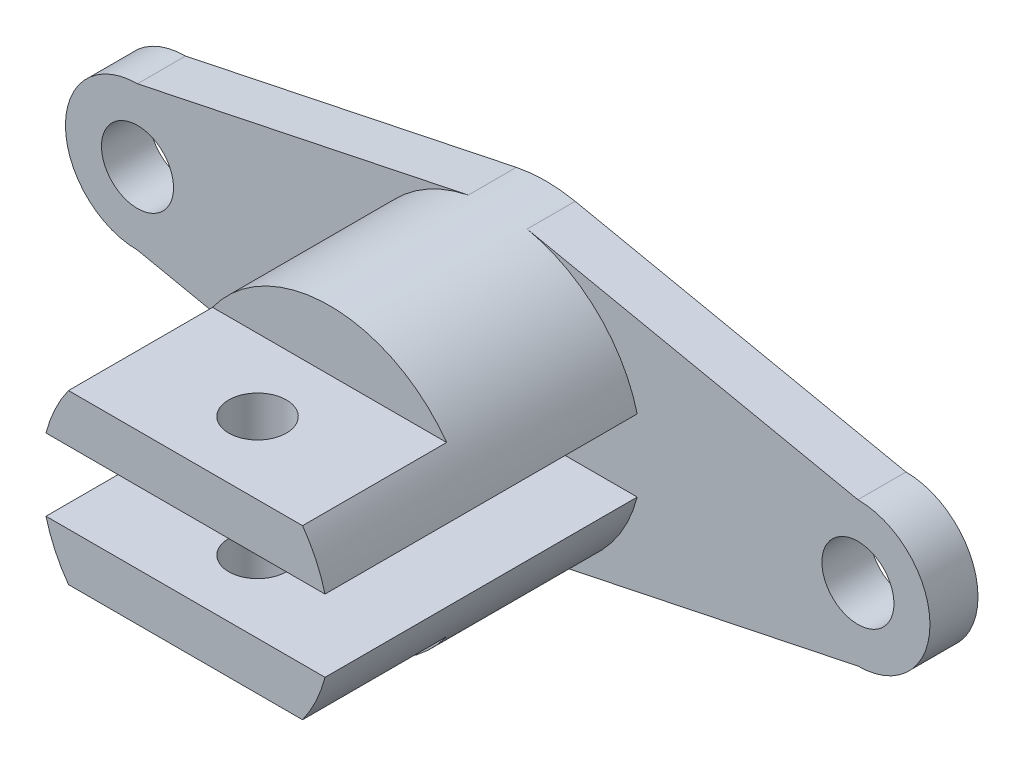
ISO-10303-21;
HEADER;
FILE_DESCRIPTION(('STEP AP214'),'2;1');
FILE_NAME('part.step','',(''),(''),'','','');
FILE_SCHEMA(('AUTOMOTIVE_DESIGN { 1 0 10303 214 1 1 1 1 }'));
ENDSEC;
DATA;
#1=APPLICATION_CONTEXT('core data for automotive mechanical design processes');
#2=APPLICATION_PROTOCOL_DEFINITION('international standard','automotive_design',2000,#1);
#3=PRODUCT_CONTEXT('',#1,'mechanical');
#4=PRODUCT('Part','Part','',(#3));
#5=PRODUCT_RELATED_PRODUCT_CATEGORY('part','',(#4));
#6=PRODUCT_DEFINITION_FORMATION('','',#4);
#7=PRODUCT_DEFINITION_CONTEXT('part definition',#1,'design');
#8=PRODUCT_DEFINITION('design','',#6,#7);
#9=PRODUCT_DEFINITION_SHAPE('','',#8);
#10=(LENGTH_UNIT() NAMED_UNIT(*) SI_UNIT(.MILLI.,.METRE.));
#11=(NAMED_UNIT(*) PLANE_ANGLE_UNIT() SI_UNIT($,.RADIAN.));
#12=(NAMED_UNIT(*) SI_UNIT($,.STERADIAN.) SOLID_ANGLE_UNIT());
#13=UNCERTAINTY_MEASURE_WITH_UNIT(LENGTH_MEASURE(1.E-05),#10,'distance_accuracy_value','');
#14=(GEOMETRIC_REPRESENTATION_CONTEXT(3) GLOBAL_UNCERTAINTY_ASSIGNED_CONTEXT((#13)) GLOBAL_UNIT_ASSIGNED_CONTEXT((#10,
#11,#12)) REPRESENTATION_CONTEXT('',''));
#15=CARTESIAN_POINT('',(0.,0.,0.));
#16=DIRECTION('',(0.,0.,1.));
#17=DIRECTION('',(1.,0.,0.));
#18=AXIS2_PLACEMENT_3D('',#15,#16,#17);
#19=CARTESIAN_POINT('',(0.,0.,10.));
#20=DIRECTION('',(0.,0.,-1.));
#21=DIRECTION('',(-1.,0.,0.));
#22=AXIS2_PLACEMENT_3D('',#19,#20,#21);
#23=CYLINDRICAL_SURFACE('',#22,30.);
#24=CARTESIAN_POINT('',(0.,0.,75.));
#25=DIRECTION('',(0.,0.,1.));
#26=DIRECTION('',(1.,0.,0.));
#27=AXIS2_PLACEMENT_3D('',#24,#25,#26);
#28=CIRCLE('',#27,30.);
#29=CARTESIAN_POINT('',(-24.3669858620224,17.5,75.));
#30=VERTEX_POINT('',#29);
#31=CARTESIAN_POINT('',(-29.0473750965556,7.5,75.));
#32=VERTEX_POINT('',#31);
#33=EDGE_CURVE('E203',#30,#32,#28,.T.);
#34=ORIENTED_EDGE('',*,*,#33,.F.);
#35=DIRECTION('',(0.,0.,1.));
#36=VECTOR('',#35,1.);
#37=CARTESIAN_POINT('',(-24.3669858620224,17.5,45.));
#38=LINE('',#37,#36);
#39=CARTESIAN_POINT('',(-24.3669858620224,17.5,45.));
#40=VERTEX_POINT('',#39);
#41=EDGE_CURVE('E58',#40,#30,#38,.T.);
#42=ORIENTED_EDGE('',*,*,#41,.F.);
#43=CARTESIAN_POINT('',(0.,0.,45.));
#44=DIRECTION('',(0.,0.,1.));
#45=DIRECTION('',(1.,0.,0.));
#46=AXIS2_PLACEMENT_3D('',#43,#44,#45);
#47=CIRCLE('',#46,30.);
#48=CARTESIAN_POINT('',(24.3669858620224,17.5,45.));
#49=VERTEX_POINT('',#48);
#50=EDGE_CURVE('E169',#49,#40,#47,.T.);
#51=ORIENTED_EDGE('',*,*,#50,.F.);
#52=DIRECTION('',(0.,0.,1.));
#53=VECTOR('',#52,1.);
#54=CARTESIAN_POINT('',(24.3669858620224,17.5,45.));
#55=LINE('',#54,#53);
#56=CARTESIAN_POINT('',(24.3669858620224,17.5,75.));
#57=VERTEX_POINT('',#56);
#58=EDGE_CURVE('E175',#49,#57,#55,.T.);
#59=ORIENTED_EDGE('',*,*,#58,.T.);
#60=CARTESIAN_POINT('',(29.0473750965556,7.5,75.));
#61=VERTEX_POINT('',#60);
#62=EDGE_CURVE('E200',#61,#57,#28,.T.);
#63=ORIENTED_EDGE('',*,*,#62,.F.);
#64=DIRECTION('',(0.,0.,1.));
#65=VECTOR('',#64,1.);
#66=CARTESIAN_POINT('',(29.0473750965556,7.5,9.99999999999999));
#67=LINE('',#66,#65);
#68=CARTESIAN_POINT('',(29.0473750965556,7.5,9.99999999999999));
#69=VERTEX_POINT('',#68);
#70=EDGE_CURVE('E195',#69,#61,#67,.T.);
#71=ORIENTED_EDGE('',*,*,#70,.F.);
#72=CARTESIAN_POINT('',(0.,0.,10.));
#73=DIRECTION('',(0.,0.,1.));
#74=DIRECTION('',(1.,0.,0.));
#75=AXIS2_PLACEMENT_3D('',#72,#73,#74);
#76=CIRCLE('',#75,30.);
#77=CARTESIAN_POINT('',(6.12644335404989,29.3677832297506,10.));
#78=VERTEX_POINT('',#77);
#79=EDGE_CURVE('E271',#69,#78,#76,.T.);
#80=ORIENTED_EDGE('',*,*,#79,.T.);
#81=DIRECTION('',(0.,0.,-1.));
#82=VECTOR('',#81,1.);
#83=CARTESIAN_POINT('',(6.12644335404989,29.3677832297506,10.));
#84=LINE('',#83,#82);
#85=CARTESIAN_POINT('',(6.12644335404989,29.3677832297506,0.));
#86=VERTEX_POINT('',#85);
#87=EDGE_CURVE('E267',#78,#86,#84,.T.);
#88=ORIENTED_EDGE('',*,*,#87,.T.);
#89=CARTESIAN_POINT('',(0.,0.,0.));
#90=DIRECTION('',(0.,0.,1.));
#91=DIRECTION('',(1.,0.,0.));
#92=AXIS2_PLACEMENT_3D('',#89,#90,#91);
#93=CIRCLE('',#92,30.);
#94=CARTESIAN_POINT('',(-6.12644335404989,29.3677832297506,0.));
#95=VERTEX_POINT('',#94);
#96=EDGE_CURVE('E239',#86,#95,#93,.T.);
#97=ORIENTED_EDGE('',*,*,#96,.T.);
#98=DIRECTION('',(0.,0.,-1.));
#99=VECTOR('',#98,1.);
#100=CARTESIAN_POINT('',(-6.12644335404989,29.3677832297506,10.));
#101=LINE('',#100,#99);
#102=CARTESIAN_POINT('',(-6.12644335404989,29.3677832297506,10.));
#103=VERTEX_POINT('',#102);
#104=EDGE_CURVE('E264',#103,#95,#101,.T.);
#105=ORIENTED_EDGE('',*,*,#104,.F.);
#106=CARTESIAN_POINT('',(-29.0473750965556,7.5,9.99999999999999));
#107=VERTEX_POINT('',#106);
#108=EDGE_CURVE('E11',#103,#107,#76,.T.);
#109=ORIENTED_EDGE('',*,*,#108,.T.);
#110=DIRECTION('',(0.,0.,1.));
#111=VECTOR('',#110,1.);
#112=CARTESIAN_POINT('',(-29.0473750965556,7.5,9.99999999999999));
#113=LINE('',#112,#111);
#114=EDGE_CURVE('E192',#107,#32,#113,.T.);
#115=ORIENTED_EDGE('',*,*,#114,.T.);
#116=EDGE_LOOP('',(#34,#42,#51,#59,#63,#71,#80,#88,#97,#105,#109,#115));
#117=FACE_BOUND('',#116,.T.);
#118=ADVANCED_FACE('F32',(#117),#23,.T.);
#119=CARTESIAN_POINT('',(0.,0.,75.));
#120=DIRECTION('',(0.,0.,1.));
#121=DIRECTION('',(1.,0.,0.));
#122=AXIS2_PLACEMENT_3D('',#119,#120,#121);
#123=PLANE('',#122);
#124=DIRECTION('',(1.,0.,0.));
#125=VECTOR('',#124,1.);
#126=CARTESIAN_POINT('',(-24.3669858620224,17.5,75.));
#127=LINE('',#126,#125);
#128=EDGE_CURVE('E165',#30,#57,#127,.T.);
#129=ORIENTED_EDGE('',*,*,#128,.F.);
#130=ORIENTED_EDGE('',*,*,#33,.T.);
#131=DIRECTION('',(-1.,0.,0.));
#132=VECTOR('',#131,1.);
#133=CARTESIAN_POINT('',(-29.0473750965556,7.5,75.));
#134=LINE('',#133,#132);
#135=EDGE_CURVE('E184',#61,#32,#134,.T.);
#136=ORIENTED_EDGE('',*,*,#135,.F.);
#137=ORIENTED_EDGE('',*,*,#62,.T.);
#138=EDGE_LOOP('',(#129,#130,#136,#137));
#139=FACE_BOUND('',#138,.T.);
#140=ADVANCED_FACE('F315',(#139),#123,.T.);
#141=CARTESIAN_POINT('',(75.,0.,10.));
#142=DIRECTION('',(0.,0.,1.));
#143=DIRECTION('',(1.,0.,0.));
#144=AXIS2_PLACEMENT_3D('',#141,#142,#143);
#145=PLANE('',#144);
#146=CARTESIAN_POINT('',(6.12644335404988,-29.3677832297506,10.));
#147=VERTEX_POINT('',#146);
#148=CARTESIAN_POINT('',(29.0473750965556,-7.50000000000001,9.99999999999999));
#149=VERTEX_POINT('',#148);
#150=EDGE_CURVE('E43',#147,#149,#76,.T.);
#151=ORIENTED_EDGE('',*,*,#150,.F.);
#152=DIRECTION('',(0.978926107658352,0.20421477846833,0.));
#153=VECTOR('',#152,1.);
#154=CARTESIAN_POINT('',(75.,-15.,10.));
#155=LINE('',#154,#153);
#156=CARTESIAN_POINT('',(75.,-15.,10.));
#157=VERTEX_POINT('',#156);
#158=EDGE_CURVE('E232',#147,#157,#155,.T.);
#159=ORIENTED_EDGE('',*,*,#158,.T.);
#160=CARTESIAN_POINT('',(75.,0.,10.));
#161=DIRECTION('',(0.,0.,1.));
#162=DIRECTION('',(1.,0.,0.));
#163=AXIS2_PLACEMENT_3D('',#160,#161,#162);
#164=CIRCLE('',#163,15.);
#165=CARTESIAN_POINT('',(75.,15.,10.));
#166=VERTEX_POINT('',#165);
#167=EDGE_CURVE('E218',#157,#166,#164,.T.);
#168=ORIENTED_EDGE('',*,*,#167,.T.);
#169=DIRECTION('',(-0.978926107658352,0.20421477846833,0.));
#170=VECTOR('',#169,1.);
#171=CARTESIAN_POINT('',(75.,15.,10.));
#172=LINE('',#171,#170);
#173=EDGE_CURVE('E221',#166,#78,#172,.T.);
#174=ORIENTED_EDGE('',*,*,#173,.T.);
#175=ORIENTED_EDGE('',*,*,#79,.F.);
#176=DIRECTION('',(-1.,0.,0.));
#177=VECTOR('',#176,1.);
#178=CARTESIAN_POINT('',(-29.0473750965556,7.5,9.99999999999999));
#179=LINE('',#178,#177);
#180=EDGE_CURVE('E183',#69,#107,#179,.T.);
#181=ORIENTED_EDGE('',*,*,#180,.T.);
#182=ORIENTED_EDGE('',*,*,#108,.F.);
#183=DIRECTION('',(-0.978926107658352,-0.20421477846833,0.));
#184=VECTOR('',#183,1.);
#185=CARTESIAN_POINT('',(-75.,15.,10.));
#186=LINE('',#185,#184);
#187=CARTESIAN_POINT('',(-75.,15.,10.));
#188=VERTEX_POINT('',#187);
#189=EDGE_CURVE('E225',#103,#188,#186,.T.);
#190=ORIENTED_EDGE('',*,*,#189,.T.);
#191=CARTESIAN_POINT('',(-75.,0.,10.));
#192=DIRECTION('',(0.,0.,1.));
#193=DIRECTION('',(1.,0.,0.));
#194=AXIS2_PLACEMENT_3D('',#191,#192,#193);
#195=CIRCLE('',#194,15.);
#196=CARTESIAN_POINT('',(-75.,-15.,10.));
#197=VERTEX_POINT('',#196);
#198=EDGE_CURVE('E227',#188,#197,#195,.T.);
#199=ORIENTED_EDGE('',*,*,#198,.T.);
#200=DIRECTION('',(0.978926107658352,-0.204214778468329,0.));
#201=VECTOR('',#200,1.);
#202=CARTESIAN_POINT('',(-75.,-15.,10.));
#203=LINE('',#202,#201);
#204=CARTESIAN_POINT('',(-6.12644335404989,-29.3677832297505,10.));
#205=VERTEX_POINT('',#204);
#206=EDGE_CURVE('E229',#197,#205,#203,.T.);
#207=ORIENTED_EDGE('',*,*,#206,.T.);
#208=CARTESIAN_POINT('',(-29.0473750965556,-7.5,9.99999999999999));
#209=VERTEX_POINT('',#208);
#210=EDGE_CURVE('E41',#209,#205,#76,.T.);
#211=ORIENTED_EDGE('',*,*,#210,.F.);
#212=DIRECTION('',(1.,0.,0.));
#213=VECTOR('',#212,1.);
#214=CARTESIAN_POINT('',(-29.0473750965556,-7.5,9.99999999999999));
#215=LINE('',#214,#213);
#216=EDGE_CURVE('E180',#209,#149,#215,.T.);
#217=ORIENTED_EDGE('',*,*,#216,.T.);
#218=EDGE_LOOP('',(#151,#159,#168,#174,#175,#181,#182,#190,#199,#207,#211,#217));
#219=FACE_BOUND('',#218,.T.);
#220=CARTESIAN_POINT('',(75.,0.,10.));
#221=DIRECTION('',(0.,0.,1.));
#222=DIRECTION('',(1.,0.,0.));
#223=AXIS2_PLACEMENT_3D('',#220,#221,#222);
#224=CIRCLE('',#223,7.50000000000001);
#225=CARTESIAN_POINT('',(82.5,0.,10.));
#226=VERTEX_POINT('',#225);
#227=EDGE_CURVE('E212',#226,#226,#224,.T.);
#228=ORIENTED_EDGE('',*,*,#227,.F.);
#229=EDGE_LOOP('',(#228));
#230=FACE_BOUND('',#229,.T.);
#231=CARTESIAN_POINT('',(-75.,0.,10.));
#232=DIRECTION('',(0.,0.,1.));
#233=DIRECTION('',(1.,0.,0.));
#234=AXIS2_PLACEMENT_3D('',#231,#232,#233);
#235=CIRCLE('',#234,7.5);
#236=CARTESIAN_POINT('',(-67.5,0.,10.));
#237=VERTEX_POINT('',#236);
#238=EDGE_CURVE('E206',#237,#237,#235,.T.);
#239=ORIENTED_EDGE('',*,*,#238,.F.);
#240=EDGE_LOOP('',(#239));
#241=FACE_BOUND('',#240,.T.);
#242=ADVANCED_FACE('F286',(#219,#230,#241),#145,.T.);
#243=CARTESIAN_POINT('',(75.,0.,0.));
#244=DIRECTION('',(0.,0.,1.));
#245=DIRECTION('',(1.,0.,0.));
#246=AXIS2_PLACEMENT_3D('',#243,#244,#245);
#247=PLANE('',#246);
#248=CARTESIAN_POINT('',(75.,0.,0.));
#249=DIRECTION('',(0.,0.,1.));
#250=DIRECTION('',(1.,0.,0.));
#251=AXIS2_PLACEMENT_3D('',#248,#249,#250);
#252=CIRCLE('',#251,15.);
#253=CARTESIAN_POINT('',(75.,-15.,0.));
#254=VERTEX_POINT('',#253);
#255=CARTESIAN_POINT('',(75.,15.,0.));
#256=VERTEX_POINT('',#255);
#257=EDGE_CURVE('E215',#254,#256,#252,.T.);
#258=ORIENTED_EDGE('',*,*,#257,.F.);
#259=DIRECTION('',(0.978926107658352,0.20421477846833,0.));
#260=VECTOR('',#259,1.);
#261=CARTESIAN_POINT('',(75.,-15.,0.));
#262=LINE('',#261,#260);
#263=CARTESIAN_POINT('',(6.12644335404988,-29.3677832297506,0.));
#264=VERTEX_POINT('',#263);
#265=EDGE_CURVE('E222',#264,#254,#262,.T.);
#266=ORIENTED_EDGE('',*,*,#265,.F.);
#267=CARTESIAN_POINT('',(0.,0.,0.));
#268=DIRECTION('',(0.,0.,1.));
#269=DIRECTION('',(1.,0.,0.));
#270=AXIS2_PLACEMENT_3D('',#267,#268,#269);
#271=CIRCLE('',#270,30.);
#272=CARTESIAN_POINT('',(-6.12644335404989,-29.3677832297505,0.));
#273=VERTEX_POINT('',#272);
#274=EDGE_CURVE('E247',#273,#264,#271,.T.);
#275=ORIENTED_EDGE('',*,*,#274,.F.);
#276=DIRECTION('',(0.978926107658352,-0.204214778468329,0.));
#277=VECTOR('',#276,1.);
#278=CARTESIAN_POINT('',(-75.,-15.,0.));
#279=LINE('',#278,#277);
#280=CARTESIAN_POINT('',(-75.,-15.,0.));
#281=VERTEX_POINT('',#280);
#282=EDGE_CURVE('E245',#281,#273,#279,.T.);
#283=ORIENTED_EDGE('',*,*,#282,.F.);
#284=CARTESIAN_POINT('',(-75.,0.,0.));
#285=DIRECTION('',(0.,0.,1.));
#286=DIRECTION('',(1.,0.,0.));
#287=AXIS2_PLACEMENT_3D('',#284,#285,#286);
#288=CIRCLE('',#287,15.);
#289=CARTESIAN_POINT('',(-75.,15.,0.));
#290=VERTEX_POINT('',#289);
#291=EDGE_CURVE('E243',#290,#281,#288,.T.);
#292=ORIENTED_EDGE('',*,*,#291,.F.);
#293=DIRECTION('',(-0.978926107658352,-0.20421477846833,0.));
#294=VECTOR('',#293,1.);
#295=CARTESIAN_POINT('',(-75.,15.,0.));
#296=LINE('',#295,#294);
#297=EDGE_CURVE('E241',#95,#290,#296,.T.);
#298=ORIENTED_EDGE('',*,*,#297,.F.);
#299=ORIENTED_EDGE('',*,*,#96,.F.);
#300=DIRECTION('',(-0.978926107658352,0.20421477846833,0.));
#301=VECTOR('',#300,1.);
#302=CARTESIAN_POINT('',(75.,15.,0.));
#303=LINE('',#302,#301);
#304=EDGE_CURVE('E237',#256,#86,#303,.T.);
#305=ORIENTED_EDGE('',*,*,#304,.F.);
#306=EDGE_LOOP('',(#258,#266,#275,#283,#292,#298,#299,#305));
#307=FACE_BOUND('',#306,.T.);
#308=CARTESIAN_POINT('',(75.,0.,0.));
#309=DIRECTION('',(0.,0.,1.));
#310=DIRECTION('',(1.,0.,0.));
#311=AXIS2_PLACEMENT_3D('',#308,#309,#310);
#312=CIRCLE('',#311,7.50000000000001);
#313=CARTESIAN_POINT('',(82.5,0.,0.));
#314=VERTEX_POINT('',#313);
#315=EDGE_CURVE('E209',#314,#314,#312,.T.);
#316=ORIENTED_EDGE('',*,*,#315,.T.);
#317=EDGE_LOOP('',(#316));
#318=FACE_BOUND('',#317,.T.);
#319=CARTESIAN_POINT('',(-75.,0.,0.));
#320=DIRECTION('',(0.,0.,1.));
#321=DIRECTION('',(1.,0.,0.));
#322=AXIS2_PLACEMENT_3D('',#319,#320,#321);
#323=CIRCLE('',#322,7.5);
#324=CARTESIAN_POINT('',(-67.5,0.,0.));
#325=VERTEX_POINT('',#324);
#326=EDGE_CURVE('E202',#325,#325,#323,.T.);
#327=ORIENTED_EDGE('',*,*,#326,.T.);
#328=EDGE_LOOP('',(#327));
#329=FACE_BOUND('',#328,.T.);
#330=ADVANCED_FACE('F296',(#307,#318,#329),#247,.F.);
#331=CARTESIAN_POINT('',(75.,0.,10.));
#332=DIRECTION('',(0.,0.,-1.));
#333=DIRECTION('',(-1.,0.,0.));
#334=AXIS2_PLACEMENT_3D('',#331,#332,#333);
#335=CYLINDRICAL_SURFACE('',#334,15.);
#336=ORIENTED_EDGE('',*,*,#257,.T.);
#337=DIRECTION('',(0.,0.,-1.));
#338=VECTOR('',#337,1.);
#339=CARTESIAN_POINT('',(75.,15.,10.));
#340=LINE('',#339,#338);
#341=EDGE_CURVE('E269',#166,#256,#340,.T.);
#342=ORIENTED_EDGE('',*,*,#341,.F.);
#343=ORIENTED_EDGE('',*,*,#167,.F.);
#344=DIRECTION('',(0.,0.,-1.));
#345=VECTOR('',#344,1.);
#346=CARTESIAN_POINT('',(75.,-15.,10.));
#347=LINE('',#346,#345);
#348=EDGE_CURVE('E234',#157,#254,#347,.T.);
#349=ORIENTED_EDGE('',*,*,#348,.T.);
#350=EDGE_LOOP('',(#336,#342,#343,#349));
#351=FACE_BOUND('',#350,.T.);
#352=ADVANCED_FACE('F34',(#351),#335,.T.);
#353=CARTESIAN_POINT('',(75.,15.,10.));
#354=DIRECTION('',(-0.20421477846833,-0.978926107658352,0.));
#355=DIRECTION('',(0.978926107658352,-0.20421477846833,0.));
#356=AXIS2_PLACEMENT_3D('',#353,#354,#355);
#357=PLANE('',#356);
#358=ORIENTED_EDGE('',*,*,#304,.T.);
#359=ORIENTED_EDGE('',*,*,#87,.F.);
#360=ORIENTED_EDGE('',*,*,#173,.F.);
#361=ORIENTED_EDGE('',*,*,#341,.T.);
#362=EDGE_LOOP('',(#358,#359,#360,#361));
#363=FACE_BOUND('',#362,.T.);
#364=ADVANCED_FACE('F359',(#363),#357,.F.);
#365=CARTESIAN_POINT('',(-75.,15.,10.));
#366=DIRECTION('',(0.20421477846833,-0.978926107658352,0.));
#367=DIRECTION('',(0.978926107658352,0.20421477846833,0.));
#368=AXIS2_PLACEMENT_3D('',#365,#366,#367);
#369=PLANE('',#368);
#370=ORIENTED_EDGE('',*,*,#297,.T.);
#371=DIRECTION('',(0.,0.,-1.));
#372=VECTOR('',#371,1.);
#373=CARTESIAN_POINT('',(-75.,15.,10.));
#374=LINE('',#373,#372);
#375=EDGE_CURVE('E261',#188,#290,#374,.T.);
#376=ORIENTED_EDGE('',*,*,#375,.F.);
#377=ORIENTED_EDGE('',*,*,#189,.F.);
#378=ORIENTED_EDGE('',*,*,#104,.T.);
#379=EDGE_LOOP('',(#370,#376,#377,#378));
#380=FACE_BOUND('',#379,.T.);
#381=ADVANCED_FACE('F354',(#380),#369,.F.);
#382=CARTESIAN_POINT('',(-75.,0.,10.));
#383=DIRECTION('',(0.,0.,-1.));
#384=DIRECTION('',(-1.,0.,0.));
#385=AXIS2_PLACEMENT_3D('',#382,#383,#384);
#386=CYLINDRICAL_SURFACE('',#385,15.);
#387=ORIENTED_EDGE('',*,*,#291,.T.);
#388=DIRECTION('',(0.,0.,-1.));
#389=VECTOR('',#388,1.);
#390=CARTESIAN_POINT('',(-75.,-15.,10.));
#391=LINE('',#390,#389);
#392=EDGE_CURVE('E258',#197,#281,#391,.T.);
#393=ORIENTED_EDGE('',*,*,#392,.F.);
#394=ORIENTED_EDGE('',*,*,#198,.F.);
#395=ORIENTED_EDGE('',*,*,#375,.T.);
#396=EDGE_LOOP('',(#387,#393,#394,#395));
#397=FACE_BOUND('',#396,.T.);
#398=ADVANCED_FACE('F350',(#397),#386,.T.);
#399=CARTESIAN_POINT('',(-75.,-15.,10.));
#400=DIRECTION('',(0.204214778468329,0.978926107658352,0.));
#401=DIRECTION('',(-0.978926107658352,0.204214778468329,0.));
#402=AXIS2_PLACEMENT_3D('',#399,#400,#401);
#403=PLANE('',#402);
#404=ORIENTED_EDGE('',*,*,#282,.T.);
#405=DIRECTION('',(0.,0.,-1.));
#406=VECTOR('',#405,1.);
#407=CARTESIAN_POINT('',(-6.12644335404989,-29.3677832297505,10.));
#408=LINE('',#407,#406);
#409=EDGE_CURVE('E255',#205,#273,#408,.T.);
#410=ORIENTED_EDGE('',*,*,#409,.F.);
#411=ORIENTED_EDGE('',*,*,#206,.F.);
#412=ORIENTED_EDGE('',*,*,#392,.T.);
#413=EDGE_LOOP('',(#404,#410,#411,#412));
#414=FACE_BOUND('',#413,.T.);
#415=ADVANCED_FACE('F291',(#414),#403,.F.);
#416=CARTESIAN_POINT('',(24.3669858620224,-17.5,75.));
#417=VERTEX_POINT('',#416);
#418=CARTESIAN_POINT('',(29.0473750965556,-7.50000000000001,75.));
#419=VERTEX_POINT('',#418);
#420=EDGE_CURVE('E163',#417,#419,#28,.T.);
#421=ORIENTED_EDGE('',*,*,#420,.F.);
#422=DIRECTION('',(0.,0.,1.));
#423=VECTOR('',#422,1.);
#424=CARTESIAN_POINT('',(24.3669858620224,-17.5,45.));
#425=LINE('',#424,#423);
#426=CARTESIAN_POINT('',(24.3669858620224,-17.5,45.));
#427=VERTEX_POINT('',#426);
#428=EDGE_CURVE('E50',#427,#417,#425,.T.);
#429=ORIENTED_EDGE('',*,*,#428,.F.);
#430=CARTESIAN_POINT('',(0.,0.,45.));
#431=DIRECTION('',(0.,0.,1.));
#432=DIRECTION('',(1.,0.,0.));
#433=AXIS2_PLACEMENT_3D('',#430,#431,#432);
#434=CIRCLE('',#433,30.);
#435=CARTESIAN_POINT('',(-24.3669858620224,-17.5,45.));
#436=VERTEX_POINT('',#435);
#437=EDGE_CURVE('E150',#436,#427,#434,.T.);
#438=ORIENTED_EDGE('',*,*,#437,.F.);
#439=DIRECTION('',(0.,0.,1.));
#440=VECTOR('',#439,1.);
#441=CARTESIAN_POINT('',(-24.3669858620224,-17.5,45.));
#442=LINE('',#441,#440);
#443=CARTESIAN_POINT('',(-24.3669858620224,-17.5,75.));
#444=VERTEX_POINT('',#443);
#445=EDGE_CURVE('E158',#436,#444,#442,.T.);
#446=ORIENTED_EDGE('',*,*,#445,.T.);
#447=CARTESIAN_POINT('',(-29.0473750965556,-7.5,75.));
#448=VERTEX_POINT('',#447);
#449=EDGE_CURVE('E204',#448,#444,#28,.T.);
#450=ORIENTED_EDGE('',*,*,#449,.F.);
#451=DIRECTION('',(0.,0.,1.));
#452=VECTOR('',#451,1.);
#453=CARTESIAN_POINT('',(-29.0473750965556,-7.5,9.99999999999999));
#454=LINE('',#453,#452);
#455=EDGE_CURVE('E187',#209,#448,#454,.T.);
#456=ORIENTED_EDGE('',*,*,#455,.F.);
#457=ORIENTED_EDGE('',*,*,#210,.T.);
#458=ORIENTED_EDGE('',*,*,#409,.T.);
#459=ORIENTED_EDGE('',*,*,#274,.T.);
#460=DIRECTION('',(0.,0.,-1.));
#461=VECTOR('',#460,1.);
#462=CARTESIAN_POINT('',(6.12644335404988,-29.3677832297506,10.));
#463=LINE('',#462,#461);
#464=EDGE_CURVE('E252',#147,#264,#463,.T.);
#465=ORIENTED_EDGE('',*,*,#464,.F.);
#466=ORIENTED_EDGE('',*,*,#150,.T.);
#467=DIRECTION('',(0.,0.,1.));
#468=VECTOR('',#467,1.);
#469=CARTESIAN_POINT('',(29.0473750965556,-7.50000000000001,9.99999999999999));
#470=LINE('',#469,#468);
#471=EDGE_CURVE('E197',#149,#419,#470,.T.);
#472=ORIENTED_EDGE('',*,*,#471,.T.);
#473=EDGE_LOOP('',(#421,#429,#438,#446,#450,#456,#457,#458,#459,#465,#466,#472));
#474=FACE_BOUND('',#473,.T.);
#475=ADVANCED_FACE('F161',(#474),#23,.T.);
#476=CARTESIAN_POINT('',(75.,-15.,10.));
#477=DIRECTION('',(-0.20421477846833,0.978926107658352,0.));
#478=DIRECTION('',(-0.978926107658352,-0.20421477846833,0.));
#479=AXIS2_PLACEMENT_3D('',#476,#477,#478);
#480=PLANE('',#479);
#481=ORIENTED_EDGE('',*,*,#265,.T.);
#482=ORIENTED_EDGE('',*,*,#348,.F.);
#483=ORIENTED_EDGE('',*,*,#158,.F.);
#484=ORIENTED_EDGE('',*,*,#464,.T.);
#485=EDGE_LOOP('',(#481,#482,#483,#484));
#486=FACE_BOUND('',#485,.T.);
#487=ADVANCED_FACE('F303',(#486),#480,.F.);
#488=CARTESIAN_POINT('',(75.,0.,10.));
#489=DIRECTION('',(0.,0.,-1.));
#490=DIRECTION('',(-1.,0.,0.));
#491=AXIS2_PLACEMENT_3D('',#488,#489,#490);
#492=CYLINDRICAL_SURFACE('',#491,7.50000000000001);
#493=ORIENTED_EDGE('',*,*,#227,.T.);
#494=EDGE_LOOP('',(#493));
#495=FACE_BOUND('',#494,.T.);
#496=ORIENTED_EDGE('',*,*,#315,.F.);
#497=EDGE_LOOP('',(#496));
#498=FACE_BOUND('',#497,.T.);
#499=ADVANCED_FACE('F349',(#495,#498),#492,.F.);
#500=CARTESIAN_POINT('',(-75.,0.,10.));
#501=DIRECTION('',(0.,0.,-1.));
#502=DIRECTION('',(-1.,0.,0.));
#503=AXIS2_PLACEMENT_3D('',#500,#501,#502);
#504=CYLINDRICAL_SURFACE('',#503,7.5);
#505=ORIENTED_EDGE('',*,*,#238,.T.);
#506=EDGE_LOOP('',(#505));
#507=FACE_BOUND('',#506,.T.);
#508=ORIENTED_EDGE('',*,*,#326,.F.);
#509=EDGE_LOOP('',(#508));
#510=FACE_BOUND('',#509,.T.);
#511=ADVANCED_FACE('F378',(#507,#510),#504,.F.);
#512=DIRECTION('',(-1.,0.,0.));
#513=VECTOR('',#512,1.);
#514=CARTESIAN_POINT('',(-24.3669858620224,-17.5,75.));
#515=LINE('',#514,#513);
#516=EDGE_CURVE('E155',#417,#444,#515,.T.);
#517=ORIENTED_EDGE('',*,*,#516,.F.);
#518=ORIENTED_EDGE('',*,*,#420,.T.);
#519=DIRECTION('',(1.,0.,0.));
#520=VECTOR('',#519,1.);
#521=CARTESIAN_POINT('',(-29.0473750965556,-7.5,75.));
#522=LINE('',#521,#520);
#523=EDGE_CURVE('E178',#448,#419,#522,.T.);
#524=ORIENTED_EDGE('',*,*,#523,.F.);
#525=ORIENTED_EDGE('',*,*,#449,.T.);
#526=EDGE_LOOP('',(#517,#518,#524,#525));
#527=FACE_BOUND('',#526,.T.);
#528=ADVANCED_FACE('F311',(#527),#123,.T.);
#529=CARTESIAN_POINT('',(-29.0473750965556,7.5,9.99999999999999));
#530=DIRECTION('',(0.,1.,0.));
#531=DIRECTION('',(0.,0.,1.));
#532=AXIS2_PLACEMENT_3D('',#529,#530,#531);
#533=PLANE('',#532);
#534=CARTESIAN_POINT('',(0.,7.5,60.));
#535=DIRECTION('',(0.,1.,0.));
#536=DIRECTION('',(0.,0.,1.));
#537=AXIS2_PLACEMENT_3D('',#534,#535,#536);
#538=CIRCLE('',#537,6.);
#539=CARTESIAN_POINT('',(0.,7.5,66.));
#540=VERTEX_POINT('',#539);
#541=EDGE_CURVE('E393',#540,#540,#538,.T.);
#542=ORIENTED_EDGE('',*,*,#541,.T.);
#543=EDGE_LOOP('',(#542));
#544=FACE_BOUND('',#543,.T.);
#545=ORIENTED_EDGE('',*,*,#135,.T.);
#546=ORIENTED_EDGE('',*,*,#114,.F.);
#547=ORIENTED_EDGE('',*,*,#180,.F.);
#548=ORIENTED_EDGE('',*,*,#70,.T.);
#549=EDGE_LOOP('',(#545,#546,#547,#548));
#550=FACE_BOUND('',#549,.T.);
#551=ADVANCED_FACE('F318',(#544,#550),#533,.F.);
#552=CARTESIAN_POINT('',(-29.0473750965556,-7.5,9.99999999999999));
#553=DIRECTION('',(0.,-1.,0.));
#554=DIRECTION('',(0.,0.,-1.));
#555=AXIS2_PLACEMENT_3D('',#552,#553,#554);
#556=PLANE('',#555);
#557=CARTESIAN_POINT('',(0.,-7.5,60.));
#558=DIRECTION('',(0.,-1.,0.));
#559=DIRECTION('',(0.,0.,-1.));
#560=AXIS2_PLACEMENT_3D('',#557,#558,#559);
#561=CIRCLE('',#560,6.);
#562=CARTESIAN_POINT('',(0.,-7.5,54.));
#563=VERTEX_POINT('',#562);
#564=EDGE_CURVE('E395',#563,#563,#561,.T.);
#565=ORIENTED_EDGE('',*,*,#564,.T.);
#566=EDGE_LOOP('',(#565));
#567=FACE_BOUND('',#566,.T.);
#568=ORIENTED_EDGE('',*,*,#523,.T.);
#569=ORIENTED_EDGE('',*,*,#471,.F.);
#570=ORIENTED_EDGE('',*,*,#216,.F.);
#571=ORIENTED_EDGE('',*,*,#455,.T.);
#572=EDGE_LOOP('',(#568,#569,#570,#571));
#573=FACE_BOUND('',#572,.T.);
#574=ADVANCED_FACE('F307',(#567,#573),#556,.F.);
#575=CARTESIAN_POINT('',(-24.3669858620224,17.5,45.));
#576=DIRECTION('',(0.,-1.,0.));
#577=DIRECTION('',(0.,0.,-1.));
#578=AXIS2_PLACEMENT_3D('',#575,#576,#577);
#579=PLANE('',#578);
#580=CARTESIAN_POINT('',(0.,17.5,60.));
#581=DIRECTION('',(0.,-1.,0.));
#582=DIRECTION('',(0.,0.,-1.));
#583=AXIS2_PLACEMENT_3D('',#580,#581,#582);
#584=CIRCLE('',#583,6.);
#585=CARTESIAN_POINT('',(0.,17.5,54.));
#586=VERTEX_POINT('',#585);
#587=EDGE_CURVE('E398',#586,#586,#584,.T.);
#588=ORIENTED_EDGE('',*,*,#587,.T.);
#589=EDGE_LOOP('',(#588));
#590=FACE_BOUND('',#589,.T.);
#591=ORIENTED_EDGE('',*,*,#128,.T.);
#592=ORIENTED_EDGE('',*,*,#58,.F.);
#593=DIRECTION('',(1.,0.,0.));
#594=VECTOR('',#593,1.);
#595=CARTESIAN_POINT('',(-24.3669858620224,17.5,45.));
#596=LINE('',#595,#594);
#597=EDGE_CURVE('E171',#40,#49,#596,.T.);
#598=ORIENTED_EDGE('',*,*,#597,.F.);
#599=ORIENTED_EDGE('',*,*,#41,.T.);
#600=EDGE_LOOP('',(#591,#592,#598,#599));
#601=FACE_BOUND('',#600,.T.);
#602=ADVANCED_FACE('F323',(#590,#601),#579,.F.);
#603=CARTESIAN_POINT('',(0.,0.,45.));
#604=DIRECTION('',(0.,0.,1.));
#605=DIRECTION('',(1.,0.,0.));
#606=AXIS2_PLACEMENT_3D('',#603,#604,#605);
#607=PLANE('',#606);
#608=ORIENTED_EDGE('',*,*,#50,.T.);
#609=ORIENTED_EDGE('',*,*,#597,.T.);
#610=EDGE_LOOP('',(#608,#609));
#611=FACE_BOUND('',#610,.T.);
#612=ADVANCED_FACE('F325',(#611),#607,.T.);
#613=CARTESIAN_POINT('',(-24.3669858620224,-17.5,45.));
#614=DIRECTION('',(0.,1.,0.));
#615=DIRECTION('',(0.,0.,1.));
#616=AXIS2_PLACEMENT_3D('',#613,#614,#615);
#617=PLANE('',#616);
#618=CARTESIAN_POINT('',(0.,-17.5,60.));
#619=DIRECTION('',(0.,1.,0.));
#620=DIRECTION('',(0.,0.,1.));
#621=AXIS2_PLACEMENT_3D('',#618,#619,#620);
#622=CIRCLE('',#621,6.);
#623=CARTESIAN_POINT('',(0.,-17.5,66.));
#624=VERTEX_POINT('',#623);
#625=EDGE_CURVE('E36',#624,#624,#622,.T.);
#626=ORIENTED_EDGE('',*,*,#625,.T.);
#627=EDGE_LOOP('',(#626));
#628=FACE_BOUND('',#627,.T.);
#629=ORIENTED_EDGE('',*,*,#516,.T.);
#630=ORIENTED_EDGE('',*,*,#445,.F.);
#631=DIRECTION('',(-1.,0.,0.));
#632=VECTOR('',#631,1.);
#633=CARTESIAN_POINT('',(-24.3669858620224,-17.5,45.));
#634=LINE('',#633,#632);
#635=EDGE_CURVE('E152',#427,#436,#634,.T.);
#636=ORIENTED_EDGE('',*,*,#635,.F.);
#637=ORIENTED_EDGE('',*,*,#428,.T.);
#638=EDGE_LOOP('',(#629,#630,#636,#637));
#639=FACE_BOUND('',#638,.T.);
#640=ADVANCED_FACE('F157',(#628,#639),#617,.F.);
#641=CARTESIAN_POINT('',(0.,0.,45.));
#642=DIRECTION('',(0.,0.,1.));
#643=DIRECTION('',(1.,0.,0.));
#644=AXIS2_PLACEMENT_3D('',#641,#642,#643);
#645=PLANE('',#644);
#646=ORIENTED_EDGE('',*,*,#437,.T.);
#647=ORIENTED_EDGE('',*,*,#635,.T.);
#648=EDGE_LOOP('',(#646,#647));
#649=FACE_BOUND('',#648,.T.);
#650=ADVANCED_FACE('F151',(#649),#645,.T.);
#651=CARTESIAN_POINT('',(0.,30.,60.));
#652=DIRECTION('',(0.,-1.,0.));
#653=DIRECTION('',(0.,0.,-1.));
#654=AXIS2_PLACEMENT_3D('',#651,#652,#653);
#655=CYLINDRICAL_SURFACE('',#654,6.);
#656=ORIENTED_EDGE('',*,*,#625,.F.);
#657=EDGE_LOOP('',(#656));
#658=FACE_BOUND('',#657,.T.);
#659=ORIENTED_EDGE('',*,*,#564,.F.);
#660=EDGE_LOOP('',(#659));
#661=FACE_BOUND('',#660,.T.);
#662=ADVANCED_FACE('F406',(#658,#661),#655,.F.);
#663=ORIENTED_EDGE('',*,*,#587,.F.);
#664=EDGE_LOOP('',(#663));
#665=FACE_BOUND('',#664,.T.);
#666=ORIENTED_EDGE('',*,*,#541,.F.);
#667=EDGE_LOOP('',(#666));
#668=FACE_BOUND('',#667,.T.);
#669=ADVANCED_FACE('F409',(#665,#668),#655,.F.);
#670=CLOSED_SHELL('',(#118,#140,#242,#330,#352,#364,#381,#398,#415,#475,#487,#499,#511,#528,
#551,#574,#602,#612,#640,#650,#662,#669));
#671=MANIFOLD_SOLID_BREP('B2',#670);
#672=ADVANCED_BREP_SHAPE_REPRESENTATION('',(#18,#671),#14);
#673=SHAPE_DEFINITION_REPRESENTATION(#9,#672);
ENDSEC;
END-ISO-10303-21;
